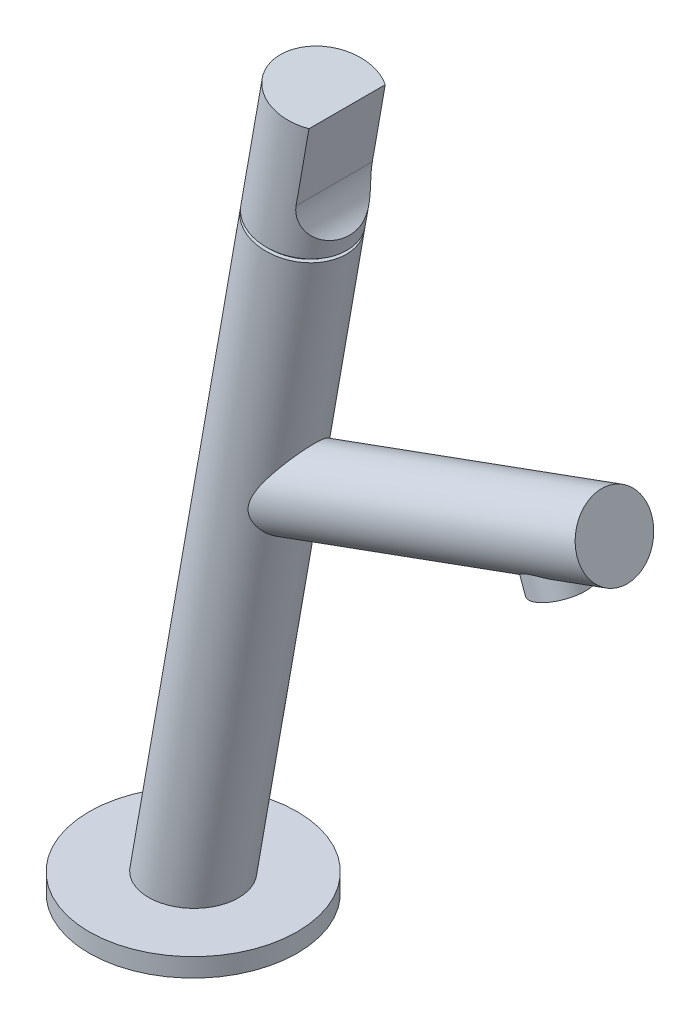
ISO-10303-21;
HEADER;
FILE_DESCRIPTION(('STEP AP214'),'2;1');
FILE_NAME('part.step','',(''),(''),'','','');
FILE_SCHEMA(('AUTOMOTIVE_DESIGN { 1 0 10303 214 1 1 1 1 }'));
ENDSEC;
DATA;
#1=APPLICATION_CONTEXT('core data for automotive mechanical design processes');
#2=APPLICATION_PROTOCOL_DEFINITION('international standard','automotive_design',2000,#1);
#3=PRODUCT_CONTEXT('',#1,'mechanical');
#4=PRODUCT('Part','Part','',(#3));
#5=PRODUCT_RELATED_PRODUCT_CATEGORY('part','',(#4));
#6=PRODUCT_DEFINITION_FORMATION('','',#4);
#7=PRODUCT_DEFINITION_CONTEXT('part definition',#1,'design');
#8=PRODUCT_DEFINITION('design','',#6,#7);
#9=PRODUCT_DEFINITION_SHAPE('','',#8);
#10=(LENGTH_UNIT() NAMED_UNIT(*) SI_UNIT(.MILLI.,.METRE.));
#11=(NAMED_UNIT(*) PLANE_ANGLE_UNIT() SI_UNIT($,.RADIAN.));
#12=(NAMED_UNIT(*) SI_UNIT($,.STERADIAN.) SOLID_ANGLE_UNIT());
#13=UNCERTAINTY_MEASURE_WITH_UNIT(LENGTH_MEASURE(1.E-05),#10,'distance_accuracy_value','');
#14=(GEOMETRIC_REPRESENTATION_CONTEXT(3) GLOBAL_UNCERTAINTY_ASSIGNED_CONTEXT((#13)) GLOBAL_UNIT_ASSIGNED_CONTEXT((#10,
#11,#12)) REPRESENTATION_CONTEXT('',''));
#15=CARTESIAN_POINT('',(0.,0.,0.));
#16=DIRECTION('',(0.,0.,1.));
#17=DIRECTION('',(1.,0.,0.));
#18=AXIS2_PLACEMENT_3D('',#15,#16,#17);
#19=CARTESIAN_POINT('',(17.6326980708469,105.,0.));
#20=DIRECTION('',(-0.93969262078591,-0.342020143325663,0.));
#21=DIRECTION('',(0.342020143325663,-0.93969262078591,0.));
#22=AXIS2_PLACEMENT_3D('',#19,#20,#21);
#23=CYLINDRICAL_SURFACE('',#22,10.);
#24=CARTESIAN_POINT('',(32.6585774148427,121.110750549649,0.));
#25=CARTESIAN_POINT('',(32.6585835440278,121.110758372539,-0.163115194572037));
#26=CARTESIAN_POINT('',(32.6541615840406,121.104890142526,-0.326181896279866));
#27=CARTESIAN_POINT('',(32.6366061158329,121.081584540446,-0.651056407102011));
#28=CARTESIAN_POINT('',(32.6234712922053,121.064145421487,-0.812864022395825));
#29=CARTESIAN_POINT('',(32.588804959874,121.018094162941,-1.13410124492102));
#30=CARTESIAN_POINT('',(32.567265939095,120.989472027407,-1.29352859181342));
#31=CARTESIAN_POINT('',(32.5163103128761,120.921708815068,-1.60885989995229));
#32=CARTESIAN_POINT('',(32.4868919892274,120.882565443932,-1.76476308464786));
#33=CARTESIAN_POINT('',(32.4133349552597,120.784598821704,-2.10698973734964));
#34=CARTESIAN_POINT('',(32.3673719468833,120.723327119445,-2.29222356102336));
#35=CARTESIAN_POINT('',(32.2658538768245,120.587794367288,-2.65510340398815));
#36=CARTESIAN_POINT('',(32.2102965295718,120.513530222265,-2.83274760266616));
#37=CARTESIAN_POINT('',(32.0310348218416,120.273479289291,-3.35383531334456));
#38=CARTESIAN_POINT('',(31.8947933299881,120.090503702427,-3.68520236083959));
#39=CARTESIAN_POINT('',(31.6334274302757,119.737723174151,-4.24007078187062));
#40=CARTESIAN_POINT('',(31.5132270972322,119.574945371901,-4.47060938358298));
#41=CARTESIAN_POINT('',(31.2620124098506,119.233216106846,-4.91328228979928));
#42=CARTESIAN_POINT('',(31.1309920684452,119.054255684391,-5.12540626992633));
#43=CARTESIAN_POINT('',(30.8605643658743,118.682911320156,-5.53265493924905));
#44=CARTESIAN_POINT('',(30.7211398941984,118.490499856004,-5.72774282190645));
#45=CARTESIAN_POINT('',(30.4361785641978,118.094765730483,-6.10182238960264));
#46=CARTESIAN_POINT('',(30.2906395648894,117.89143924021,-6.28080836652553));
#47=CARTESIAN_POINT('',(30.0151134122891,117.503652265959,-6.6006956413746));
#48=CARTESIAN_POINT('',(29.885674485064,117.320343328374,-6.74347838412511));
#49=CARTESIAN_POINT('',(29.624426846889,116.947623959471,-7.01859031894486));
#50=CARTESIAN_POINT('',(29.4926177519202,116.758212535409,-7.15091779795378));
#51=CARTESIAN_POINT('',(29.2273806090984,116.373776939098,-7.40581285969825));
#52=CARTESIAN_POINT('',(29.09395141573,116.178748643417,-7.52837300992077));
#53=CARTESIAN_POINT('',(28.8263516671791,115.783666134087,-7.76414761981822));
#54=CARTESIAN_POINT('',(28.6921811921184,115.583612455627,-7.87736306922264));
#55=CARTESIAN_POINT('',(28.4237907144195,115.178688956517,-8.09493725197289));
#56=CARTESIAN_POINT('',(28.2895707084137,114.973817806502,-8.19929350314242));
#57=CARTESIAN_POINT('',(28.0218808914487,114.559479003019,-8.39946169222506));
#58=CARTESIAN_POINT('',(27.8884110546934,114.350011508837,-8.49527392564708));
#59=CARTESIAN_POINT('',(27.6231034777992,113.926636681918,-8.67855942479455));
#60=CARTESIAN_POINT('',(27.4912648399867,113.712731981941,-8.76603747237573));
#61=CARTESIAN_POINT('',(27.2300510059245,113.280299442793,-8.93286318407677));
#62=CARTESIAN_POINT('',(27.1006757908945,113.061771638894,-9.01221091019936));
#63=CARTESIAN_POINT('',(26.8303373471639,112.593764166889,-9.17171865518467));
#64=CARTESIAN_POINT('',(26.6898145900574,112.343681975092,-9.25086360529841));
#65=CARTESIAN_POINT('',(26.4150024414145,111.837157827087,-9.39883049395722));
#66=CARTESIAN_POINT('',(26.2807119479651,111.580717007531,-9.46765426220674));
#67=CARTESIAN_POINT('',(26.0207274510571,111.061032206365,-9.59447998343542));
#68=CARTESIAN_POINT('',(25.8950290583293,110.79779179447,-9.65248748846466));
#69=CARTESIAN_POINT('',(25.6551967150465,110.263811131705,-9.75683049423396));
#70=CARTESIAN_POINT('',(25.5410602852705,109.993072504593,-9.80316850043408));
#71=CARTESIAN_POINT('',(25.3544743012035,109.51110728481,-9.87294726427189));
#72=CARTESIAN_POINT('',(25.278670966909,109.301594705019,-9.8992165061423));
#73=CARTESIAN_POINT('',(25.1380583473415,108.87797746278,-9.94338589007142));
#74=CARTESIAN_POINT('',(25.0732495230931,108.663872608191,-9.96128568123546));
#75=CARTESIAN_POINT('',(24.957242708444,108.231906773262,-9.98752970784781));
#76=CARTESIAN_POINT('',(24.9060134212286,108.014055683985,-9.9958960645972));
#77=CARTESIAN_POINT('',(24.8196355841844,107.57502673925,-10.0017579733602));
#78=CARTESIAN_POINT('',(24.7844808366538,107.353850199983,-9.99925771901852));
#79=CARTESIAN_POINT('',(24.738549632477,106.960251754469,-9.98387543028362));
#80=CARTESIAN_POINT('',(24.724049713732,106.788166181503,-9.97348037267676));
#81=CARTESIAN_POINT('',(24.7069038376633,106.444088740967,-9.94466851237666));
#82=CARTESIAN_POINT('',(24.7042548302703,106.272096860678,-9.92625377504761));
#83=CARTESIAN_POINT('',(24.711168439564,105.929597222872,-9.88089998289528));
#84=CARTESIAN_POINT('',(24.7207226971649,105.759088529907,-9.85396677262498));
#85=CARTESIAN_POINT('',(24.7518207151686,105.420808026322,-9.79125074743117));
#86=CARTESIAN_POINT('',(24.7733649015991,105.25303631317,-9.75546761807623));
#87=CARTESIAN_POINT('',(24.827603141175,104.921898805145,-9.67505000636879));
#88=CARTESIAN_POINT('',(24.8602713257464,104.758523728681,-9.63043615951594));
#89=CARTESIAN_POINT('',(24.9355489592783,104.436801929553,-9.53241089347394));
#90=CARTESIAN_POINT('',(24.9781585022122,104.278455254437,-9.47899939112391));
#91=CARTESIAN_POINT('',(25.0719143717843,103.967245461311,-9.36352799302043));
#92=CARTESIAN_POINT('',(25.1230749102308,103.814391995623,-9.30145372852911));
#93=CARTESIAN_POINT('',(25.23231650298,103.514846021885,-9.16904084829354));
#94=CARTESIAN_POINT('',(25.2903994425716,103.368155206988,-9.09869998124533));
#95=CARTESIAN_POINT('',(25.4394948203249,103.016105956614,-8.91642344401841));
#96=CARTESIAN_POINT('',(25.5335023732515,102.814283940584,-8.80008306097505));
#97=CARTESIAN_POINT('',(25.7286456810593,102.424173140306,-8.55172024473874));
#98=CARTESIAN_POINT('',(25.8297844410408,102.235890129737,-8.41969118406121));
#99=CARTESIAN_POINT('',(26.0357375811583,101.872464007347,-8.14074789278755));
#100=CARTESIAN_POINT('',(26.1405561264634,101.697336539357,-7.99381641395807));
#101=CARTESIAN_POINT('',(26.3508008400341,101.360228859791,-7.68605398116422));
#102=CARTESIAN_POINT('',(26.4562269388711,101.198247176671,-7.52522458711055));
#103=CARTESIAN_POINT('',(26.6681857456535,100.882877466842,-7.18573712207531));
#104=CARTESIAN_POINT('',(26.7746670089377,100.729856229563,-7.00670635173645));
#105=CARTESIAN_POINT('',(26.9834802762397,100.437442586228,-6.63557305841324));
#106=CARTESIAN_POINT('',(27.0858122134697,100.298050399495,-6.4434703251548));
#107=CARTESIAN_POINT('',(27.2843834982497,100.033039969077,-6.04711349189572));
#108=CARTESIAN_POINT('',(27.3806249586199,99.9074169376033,-5.84286365401973));
#109=CARTESIAN_POINT('',(27.5653921785508,99.6701153129157,-5.42308374337919));
#110=CARTESIAN_POINT('',(27.653917864433,99.5584368528558,-5.20755356292913));
#111=CARTESIAN_POINT('',(27.8322352444692,99.3363342705343,-4.73878463248761));
#112=CARTESIAN_POINT('',(27.9208167467516,99.2277912576614,-4.4841885946432));
#113=CARTESIAN_POINT('',(28.0845793352241,99.0292627492414,-3.96366805034683));
#114=CARTESIAN_POINT('',(28.159759272407,98.9392788447891,-3.69774257496459));
#115=CARTESIAN_POINT('',(28.2951927835254,98.778436648337,-3.15645157394409));
#116=CARTESIAN_POINT('',(28.3554460665817,98.7075787290474,-2.88108586446074));
#117=CARTESIAN_POINT('',(28.4597898385544,98.5855193445931,-2.3230387593486));
#118=CARTESIAN_POINT('',(28.5038815798801,98.5343163562909,-2.04035793240982));
#119=CARTESIAN_POINT('',(28.5730453115178,98.4542462553174,-1.48565032390514));
#120=CARTESIAN_POINT('',(28.5990291713904,98.4243065478258,-1.21389146990775));
#121=CARTESIAN_POINT('',(28.6352749382821,98.3825903006709,-0.667942202577422));
#122=CARTESIAN_POINT('',(28.6455373500802,98.3708131778494,-0.393751867597988));
#123=CARTESIAN_POINT('',(28.6501477849115,98.3655190187764,0.154871913823006));
#124=CARTESIAN_POINT('',(28.644499593468,98.3719976390354,0.429305286908493));
#125=CARTESIAN_POINT('',(28.6174026031899,98.4031521715927,0.976348451901919));
#126=CARTESIAN_POINT('',(28.5959540943933,98.4278277498589,1.24895827719107));
#127=CARTESIAN_POINT('',(28.5388549402682,98.4937938512171,1.77916802609849));
#128=CARTESIAN_POINT('',(28.5038224866392,98.5343618580693,2.03692516795231));
#129=CARTESIAN_POINT('',(28.4201944643896,98.631763519465,2.54709665209512));
#130=CARTESIAN_POINT('',(28.3715993656697,98.6885966104791,2.79951117916207));
#131=CARTESIAN_POINT('',(28.2616709698928,98.8181566326143,3.29733996016417));
#132=CARTESIAN_POINT('',(28.2003395595676,98.8908812096857,3.54275524483574));
#133=CARTESIAN_POINT('',(28.0659552627637,99.0518222572148,4.02514834046211));
#134=CARTESIAN_POINT('',(27.9929020144456,99.1400392059119,4.26212589067783));
#135=CARTESIAN_POINT('',(27.8339752076931,99.3343768387185,4.73316103897609));
#136=CARTESIAN_POINT('',(27.7477869130365,99.4409490788513,4.96692604692305));
#137=CARTESIAN_POINT('',(27.5658051963857,99.6696563556579,5.4228081901721));
#138=CARTESIAN_POINT('',(27.4700115373584,99.7917917764072,5.64492503782448));
#139=CARTESIAN_POINT('',(27.2704364243321,100.051473824103,6.07666866386901));
#140=CARTESIAN_POINT('',(27.1666439428611,100.189041850434,6.28627746592054));
#141=CARTESIAN_POINT('',(26.9532175710008,100.479241873497,6.69163126386777));
#142=CARTESIAN_POINT('',(26.8435836154442,100.631874038299,6.88737610504059));
#143=CARTESIAN_POINT('',(26.6133657576365,100.962890020389,7.27665662398996));
#144=CARTESIAN_POINT('',(26.4925401143603,101.142313689355,7.4691674271816));
#145=CARTESIAN_POINT('',(26.2503043543567,101.518493794434,7.83620239137012));
#146=CARTESIAN_POINT('',(26.1288940914144,101.715254804979,8.01072177884254));
#147=CARTESIAN_POINT('',(25.8899667080383,102.126050271411,8.34017244926375));
#148=CARTESIAN_POINT('',(25.7724427603974,102.340051886618,8.49513959530087));
#149=CARTESIAN_POINT('',(25.5463427947162,102.7859547168,8.78439300551486));
#150=CARTESIAN_POINT('',(25.4377605173172,103.017843186544,8.9186937947806));
#151=CARTESIAN_POINT('',(25.2735463390077,103.409718529625,9.11918910762259));
#152=CARTESIAN_POINT('',(25.2132515421749,103.56433208972,9.19212425793358));
#153=CARTESIAN_POINT('',(25.100510609088,103.880298439205,9.32883937251116));
#154=CARTESIAN_POINT('',(25.0480617566715,104.04164887152,9.39262250477201));
#155=CARTESIAN_POINT('',(24.9529175205297,104.370216987381,9.51055308322418));
#156=CARTESIAN_POINT('',(24.9102007315235,104.537420842774,9.56472161716356));
#157=CARTESIAN_POINT('',(24.8360396351487,104.877135365964,9.663339590701));
#158=CARTESIAN_POINT('',(24.8045952117089,105.049645979097,9.70778913037343));
#159=CARTESIAN_POINT('',(24.7541345759013,105.399688885852,9.78712117489705));
#160=CARTESIAN_POINT('',(24.7351889433524,105.577243889922,9.82194871377079));
#161=CARTESIAN_POINT('',(24.7107237841275,105.934889651566,9.88189353820534));
#162=CARTESIAN_POINT('',(24.7052039124204,106.114980343855,9.90701107329135));
#163=CARTESIAN_POINT('',(24.7075907975414,106.476297733562,9.94802034260204));
#164=CARTESIAN_POINT('',(24.7155119640919,106.657525442379,9.96390215097524));
#165=CARTESIAN_POINT('',(24.7441431228107,107.019505438071,9.9870767060936));
#166=CARTESIAN_POINT('',(24.7648551278332,107.20025764562,9.99436810046698));
#167=CARTESIAN_POINT('',(24.8269696152258,107.621299889983,10.0022989642439));
#168=CARTESIAN_POINT('',(24.873009789799,107.860964265981,9.99983874089815));
#169=CARTESIAN_POINT('',(24.9827116290667,108.335763491882,9.98281341632211));
#170=CARTESIAN_POINT('',(25.0463814941355,108.570896179318,9.96824267560821));
#171=CARTESIAN_POINT('',(25.1881980063599,109.036557637538,9.92857970583605));
#172=CARTESIAN_POINT('',(25.2663880185986,109.267070263357,9.90345566751866));
#173=CARTESIAN_POINT('',(25.4341949254048,109.722736175066,9.84396301395157));
#174=CARTESIAN_POINT('',(25.5238169732966,109.947886989307,9.80959022175515));
#175=CARTESIAN_POINT('',(25.7120474005962,110.39299266046,9.73253734350148));
#176=CARTESIAN_POINT('',(25.8106585398882,110.612945895302,9.68985470150544));
#177=CARTESIAN_POINT('',(26.0148680384677,111.047870165592,9.59684805344182));
#178=CARTESIAN_POINT('',(26.1204653871339,111.26284191561,9.54652515125242));
#179=CARTESIAN_POINT('',(26.3372007398627,111.688372165987,9.4386052058157));
#180=CARTESIAN_POINT('',(26.4483439805361,111.898926218034,9.38100120573475));
#181=CARTESIAN_POINT('',(26.6748302488924,112.315722433039,9.25879844072449));
#182=CARTESIAN_POINT('',(26.7901737640921,112.521964091065,9.19419886210478));
#183=CARTESIAN_POINT('',(27.0242425654894,112.9307308317,9.05799221617883));
#184=CARTESIAN_POINT('',(27.1429738536329,113.133248119028,8.98637208399498));
#185=CARTESIAN_POINT('',(27.3827503621953,113.53431924358,8.83622372907973));
#186=CARTESIAN_POINT('',(27.5037957683274,113.732872760067,8.75769495007719));
#187=CARTESIAN_POINT('',(27.8691202702546,114.32248684976,8.51173267447009));
#188=CARTESIAN_POINT('',(28.1157599871805,114.707797644856,8.3338244398781));
#189=CARTESIAN_POINT('',(28.5803868012147,115.417119543923,7.97171972289332));
#190=CARTESIAN_POINT('',(28.7982470581211,115.742924285523,7.79086138811495));
#191=CARTESIAN_POINT('',(29.2318043393023,116.381303103054,7.40439831152286));
#192=CARTESIAN_POINT('',(29.4475006844863,116.693873118948,7.1987860491983));
#193=CARTESIAN_POINT('',(29.872530836446,117.302436469418,6.76118318491261));
#194=CARTESIAN_POINT('',(30.0818848834541,117.59848581816,6.52929096680271));
#195=CARTESIAN_POINT('',(30.4908972812762,118.171497516375,6.03571296429244));
#196=CARTESIAN_POINT('',(30.6905632097402,118.448474856658,5.77405101842275));
#197=CARTESIAN_POINT('',(31.0853381019661,118.992149535675,5.20264524287717));
#198=CARTESIAN_POINT('',(31.2796754584902,119.257571474953,4.89111303558558));
#199=CARTESIAN_POINT('',(31.5526517673941,119.628284727382,4.3932980940917));
#200=CARTESIAN_POINT('',(31.640563247994,119.747296131927,4.22225551596867));
#201=CARTESIAN_POINT('',(31.8088591676043,119.974558530412,3.86968218026223));
#202=CARTESIAN_POINT('',(31.8892442171621,120.082810397214,3.68815227535071));
#203=CARTESIAN_POINT('',(32.0896573827858,120.35213597271,3.19437329853833));
#204=CARTESIAN_POINT('',(32.2020908448163,120.502620794218,2.87288371211159));
#205=CARTESIAN_POINT('',(32.3462547607993,120.695151381735,2.37143204408946));
#206=CARTESIAN_POINT('',(32.39021114084,120.753772661608,2.20117613589716));
#207=CARTESIAN_POINT('',(32.4690157023817,120.858772239624,1.854894558388));
#208=CARTESIAN_POINT('',(32.50386694728,120.90515465555,1.67887085212052));
#209=CARTESIAN_POINT('',(32.5744647671035,120.999052361117,1.25652439448266));
#210=CARTESIAN_POINT('',(32.6058412597575,121.040730095842,1.00812130377327));
#211=CARTESIAN_POINT('',(32.6478918772314,121.096571856792,0.506439571941107));
#212=CARTESIAN_POINT('',(32.6585679020994,121.110738408207,0.253161380448002));
#213=CARTESIAN_POINT('',(32.6585774148427,121.110750549649,0.));
#214=B_SPLINE_CURVE_WITH_KNOTS('',3,(#24,#25,#26,#27,#28,#29,#30,#31,#32,#33,#34,#35,#36,#37,
#38,#39,#40,#41,#42,#43,#44,#45,#46,#47,#48,#49,#50,#51,#52,#53,#54,#55,#56,#57,#58,#59,#60,#61,
#62,#63,#64,#65,#66,#67,#68,#69,#70,#71,#72,#73,#74,#75,#76,#77,#78,#79,#80,#81,#82,#83,#84,#85,
#86,#87,#88,#89,#90,#91,#92,#93,#94,#95,#96,#97,#98,#99,#100,#101,#102,#103,#104,#105,#106,#107,
#108,#109,#110,#111,#112,#113,#114,#115,#116,#117,#118,#119,#120,#121,#122,#123,#124,#125,#126,
#127,#128,#129,#130,#131,#132,#133,#134,#135,#136,#137,#138,#139,#140,#141,#142,#143,#144,#145,
#146,#147,#148,#149,#150,#151,#152,#153,#154,#155,#156,#157,#158,#159,#160,#161,#162,#163,#164,
#165,#166,#167,#168,#169,#170,#171,#172,#173,#174,#175,#176,#177,#178,#179,#180,#181,#182,#183,
#184,#185,#186,#187,#188,#189,#190,#191,#192,#193,#194,#195,#196,#197,#198,#199,#200,#201,#202,
#203,#204,#205,#206,#207,#208,#209,#210,#211,#212,#213),.UNSPECIFIED.,.T.,.F.,(4,2,2,2,2,2,2,2,
2,2,2,2,2,2,2,2,2,2,2,2,2,2,2,2,2,2,2,2,2,2,2,2,2,2,2,2,2,2,2,2,2,2,2,2,2,2,2,2,2,2,2,2,2,2,2,2,
2,2,2,2,2,2,2,2,2,2,2,2,2,2,2,2,2,2,2,2,2,2,2,2,2,2,2,2,2,2,2,2,2,2,2,2,2,2,4),(0.,
0.489098584460538,0.978271026410201,1.46788171956536,1.95759926725277,2.55801397682528,
3.15857191543547,4.36042090990807,5.27954818595711,6.19918749760886,7.12076692120853,
8.04267176727806,8.84030306429715,9.63806478070862,10.4364278749609,11.2347063030306,
12.0332076601714,12.8316813891099,13.6296941881295,14.4277009009627,15.3201429153883,
16.2124265331929,17.1042508681949,17.9958835635282,18.6685386979945,19.3412220314377,
20.0123412771627,20.6832015474151,21.2016904969924,21.7200459953769,22.238046616999,
22.7560656454661,23.2728881687938,23.7897155777276,24.3074106577753,24.8252470536347,
25.5777370920606,26.33054614814,27.0842366787052,27.8378427241794,28.6125144600088,
29.3871986600648,30.161612627796,30.9360339896633,31.8067081408242,32.6774569049326,
33.5482226361967,34.4189208747842,35.2417822696695,36.0646172438435,36.8872564619029,
37.7098805795835,38.4987848829011,39.2876618566976,40.0764220510879,40.8652065982752,
41.6772706405311,42.4893547271623,43.3025791311426,44.1158126093416,44.9834801495041,
45.8513773119432,46.7176586742345,47.5833283729831,48.1267019816695,48.6698870440843,
49.211865604115,49.753838583247,50.2988464303949,50.8438402711391,51.3894187521773,
51.9350831110773,52.6660454903197,53.3973484463751,54.1308716608698,54.8647267087103,
55.5988078328823,56.332782996481,57.0674648251444,57.8022322002664,58.5383938789568,
59.2746148863352,60.7459878320336,62.0401458979982,63.3346981401091,64.6245548202513,
65.9133858041657,67.2689682689423,67.9468916676648,68.624760025199,69.7368978336195,
70.2923646047831,70.8476442493345,71.6068147236429,72.3659155121505),.UNSPECIFIED.);
#215=CARTESIAN_POINT('',(32.6585774148427,121.110750549649,0.));
#216=VERTEX_POINT('',#215);
#217=EDGE_CURVE('E91',#216,#216,#214,.T.);
#218=ORIENTED_EDGE('',*,*,#217,.F.);
#219=EDGE_LOOP('',(#218));
#220=FACE_BOUND('',#219,.T.);
#221=CARTESIAN_POINT('',(113.314588405633,139.825360040185,0.));
#222=DIRECTION('',(-0.93969262078591,-0.342020143325663,0.));
#223=DIRECTION('',(0.342020143325663,-0.93969262078591,0.));
#224=AXIS2_PLACEMENT_3D('',#221,#222,#223);
#225=CIRCLE('',#224,9.99999999999999);
#226=CARTESIAN_POINT('',(116.73478983889,130.428433832326,0.));
#227=VERTEX_POINT('',#226);
#228=EDGE_CURVE('E182',#227,#227,#225,.T.);
#229=ORIENTED_EDGE('',*,*,#228,.T.);
#230=EDGE_LOOP('',(#229));
#231=FACE_BOUND('',#230,.T.);
#232=CARTESIAN_POINT('',(104.518785768673,125.982171969092,0.));
#233=CARTESIAN_POINT('',(104.518787021234,125.982171433917,-0.1740464643457));
#234=CARTESIAN_POINT('',(104.511121173252,125.984227232528,-0.348081296022131));
#235=CARTESIAN_POINT('',(104.480601750393,125.992378584505,-0.694704313850658));
#236=CARTESIAN_POINT('',(104.457749494529,125.998473787029,-0.867292624321989));
#237=CARTESIAN_POINT('',(104.397252777113,126.014501232162,-1.20970785689396));
#238=CARTESIAN_POINT('',(104.35960474684,126.024434400474,-1.37953410248933));
#239=CARTESIAN_POINT('',(104.270143932486,126.0478116635,-1.71515750012039));
#240=CARTESIAN_POINT('',(104.218330658133,126.061255879734,-1.88095451248456));
#241=CARTESIAN_POINT('',(104.101626901689,126.09115394676,-2.2066220420918));
#242=CARTESIAN_POINT('',(104.036805092623,126.10759195265,-2.36651866830127));
#243=CARTESIAN_POINT('',(103.894796320834,126.143024931631,-2.68045503693136));
#244=CARTESIAN_POINT('',(103.817604515474,126.162020905655,-2.83449245623212));
#245=CARTESIAN_POINT('',(103.568900527168,126.222012422491,-3.28661262536489));
#246=CARTESIAN_POINT('',(103.380157005375,126.266038927187,-3.57498410354819));
#247=CARTESIAN_POINT('',(102.945864986865,126.361170265501,-4.14570734329065));
#248=CARTESIAN_POINT('',(102.69677168198,126.412556829654,-4.42527784942221));
#249=CARTESIAN_POINT('',(102.160557005465,126.511789052028,-4.94680356367577));
#250=CARTESIAN_POINT('',(101.873378777226,126.559629246098,-5.18870133299367));
#251=CARTESIAN_POINT('',(101.392785127656,126.625789120629,-5.54086378447159));
#252=CARTESIAN_POINT('',(101.209420038662,126.648155245969,-5.66433193234375));
#253=CARTESIAN_POINT('',(100.833030704956,126.686505594787,-5.89691627010617));
#254=CARTESIAN_POINT('',(100.640003972106,126.702488164712,-6.00602873649263));
#255=CARTESIAN_POINT('',(100.24593152285,126.725633802041,-6.20896467320644));
#256=CARTESIAN_POINT('',(100.044898785701,126.732810588864,-6.30281172864575));
#257=CARTESIAN_POINT('',(99.6359217361835,126.735657335171,-6.4744747581478));
#258=CARTESIAN_POINT('',(99.427977484552,126.731327395745,-6.55229087304228));
#259=CARTESIAN_POINT('',(99.0728200840661,126.711831787249,-6.66903276954775));
#260=CARTESIAN_POINT('',(98.9268850782301,126.700465243448,-6.71251962436662));
#261=CARTESIAN_POINT('',(98.633523406772,126.669960373543,-6.79082449043627));
#262=CARTESIAN_POINT('',(98.4860971992548,126.650824367546,-6.82564508459341));
#263=CARTESIAN_POINT('',(98.1909575570296,126.603995778551,-6.88610635664974));
#264=CARTESIAN_POINT('',(98.0432449727635,126.576317087459,-6.91176179362068));
#265=CARTESIAN_POINT('',(97.7484555739606,126.511799246914,-6.95354913429054));
#266=CARTESIAN_POINT('',(97.6013787579966,126.474960118037,-6.96968105937952));
#267=CARTESIAN_POINT('',(97.308284158712,126.391624711378,-6.99217933707682));
#268=CARTESIAN_POINT('',(97.1622775169693,126.345073489598,-6.99848832140893));
#269=CARTESIAN_POINT('',(96.8734954367941,126.242616664197,-7.00103012452934));
#270=CARTESIAN_POINT('',(96.7307199864249,126.18671109514,-6.99726298054756));
#271=CARTESIAN_POINT('',(96.4494671206797,126.066106651843,-6.97972342485211));
#272=CARTESIAN_POINT('',(96.3109923218574,126.001402548432,-6.9659450419175));
#273=CARTESIAN_POINT('',(96.0393523874917,125.864211621269,-6.92865962626302));
#274=CARTESIAN_POINT('',(95.9061873623537,125.791724635805,-6.90515239136799));
#275=CARTESIAN_POINT('',(95.5328707919683,125.574399390171,-6.82436103683876));
#276=CARTESIAN_POINT('',(95.2999531598285,125.421274001135,-6.7554564433391));
#277=CARTESIAN_POINT('',(94.8560201743664,125.100297131141,-6.58820457637544));
#278=CARTESIAN_POINT('',(94.6450225638191,124.932433920581,-6.48983369821029));
#279=CARTESIAN_POINT('',(94.2911691344521,124.629881842688,-6.29267017882308));
#280=CARTESIAN_POINT('',(94.1439350005964,124.496641657737,-6.1993830447497));
#281=CARTESIAN_POINT('',(93.8611134434734,124.228825388165,-5.9980524137914));
#282=CARTESIAN_POINT('',(93.7255308142349,124.094248778836,-5.8900028898055));
#283=CARTESIAN_POINT('',(93.4652836544774,123.826129109337,-5.6596572916398));
#284=CARTESIAN_POINT('',(93.3406391509747,123.692588336957,-5.53733600254513));
#285=CARTESIAN_POINT('',(93.1021412756586,123.429097634386,-5.27911187332845));
#286=CARTESIAN_POINT('',(92.9882865258339,123.299147247155,-5.14321077211623));
#287=CARTESIAN_POINT('',(92.7698582530513,123.043456532487,-4.85650052922115));
#288=CARTESIAN_POINT('',(92.6654125762158,122.917785485182,-4.70553198683854));
#289=CARTESIAN_POINT('',(92.4674045146724,122.674499876183,-4.39047411113203));
#290=CARTESIAN_POINT('',(92.3738431434464,122.556886065149,-4.22638355836112));
#291=CARTESIAN_POINT('',(92.1980649877589,122.33213540197,-3.88592051221827));
#292=CARTESIAN_POINT('',(92.1158280745372,122.224980061733,-3.70957067160869));
#293=CARTESIAN_POINT('',(91.9630131244047,122.02314850789,-3.34508447217408));
#294=CARTESIAN_POINT('',(91.8924316084694,121.928468572207,-3.15695165366554));
#295=CARTESIAN_POINT('',(91.7778203266989,121.773101722576,-2.81276640707636));
#296=CARTESIAN_POINT('',(91.7313701423671,121.709527030269,-2.65881551579899));
#297=CARTESIAN_POINT('',(91.6462801441249,121.592287849809,-2.34510246813286));
#298=CARTESIAN_POINT('',(91.6076387553609,121.53862136359,-2.18534149118853));
#299=CARTESIAN_POINT('',(91.5385263302448,121.442146838899,-1.8609232178022));
#300=CARTESIAN_POINT('',(91.5080514732487,121.399333723275,-1.6962682511683));
#301=CARTESIAN_POINT('',(91.4555698805464,121.325340499887,-1.363024423342));
#302=CARTESIAN_POINT('',(91.4335633171631,121.294160628851,-1.19443548217044));
#303=CARTESIAN_POINT('',(91.3982089363871,121.243963219187,-0.853835038131658));
#304=CARTESIAN_POINT('',(91.3848970766268,121.22499619226,-0.681812316714426));
#305=CARTESIAN_POINT('',(91.3672492968561,121.199834142727,-0.336372899362727));
#306=CARTESIAN_POINT('',(91.3629133753943,121.193639118054,-0.162956203653694));
#307=CARTESIAN_POINT('',(91.3632756904513,121.194156384205,0.183842714295633));
#308=CARTESIAN_POINT('',(91.3679736730716,121.200868312277,0.357224937367816));
#309=CARTESIAN_POINT('',(91.386340402398,121.227052544406,0.702536349823644));
#310=CARTESIAN_POINT('',(91.4000088267941,121.246524389996,0.874465591188444));
#311=CARTESIAN_POINT('',(91.43495201614,121.296126440017,1.20433159742845));
#312=CARTESIAN_POINT('',(91.4556691504334,121.325473894298,1.3624465460305));
#313=CARTESIAN_POINT('',(91.5045710860889,121.394432887431,1.6752967520272));
#314=CARTESIAN_POINT('',(91.5327584286907,121.434047919039,1.83003083988353));
#315=CARTESIAN_POINT('',(91.5963240976734,121.522863367647,2.13515144391824));
#316=CARTESIAN_POINT('',(91.631700432097,121.572061129265,2.28553915125477));
#317=CARTESIAN_POINT('',(91.7093733798167,121.679304896292,2.58133987412349));
#318=CARTESIAN_POINT('',(91.7516726375147,121.737354282241,2.72675096293517));
#319=CARTESIAN_POINT('',(91.8461051797945,121.865834440002,3.02198830167896));
#320=CARTESIAN_POINT('',(91.8987206157152,121.936848592446,3.17140685506114));
#321=CARTESIAN_POINT('',(92.0112165647709,122.087008478879,3.46327176168365));
#322=CARTESIAN_POINT('',(92.0710997411316,122.166157192099,3.60571553205286));
#323=CARTESIAN_POINT('',(92.261273565767,122.414287838812,4.0219990302419));
#324=CARTESIAN_POINT('',(92.4021132036811,122.593988532754,4.28486774744838));
#325=CARTESIAN_POINT('',(92.6463138980461,122.894474366115,4.67606291543348));
#326=CARTESIAN_POINT('',(92.7410400538969,123.008837296274,4.81502294558395));
#327=CARTESIAN_POINT('',(92.9395949913232,123.242741339593,5.0817445026344));
#328=CARTESIAN_POINT('',(93.0434250421635,123.362283173617,5.20950446303962));
#329=CARTESIAN_POINT('',(93.2603633441491,123.604901568294,5.45354754357961));
#330=CARTESIAN_POINT('',(93.3734800769528,123.727981291971,5.56981995358198));
#331=CARTESIAN_POINT('',(93.6091603843487,123.975736110891,5.79035746552295));
#332=CARTESIAN_POINT('',(93.7317200962199,124.100410536587,5.89462743407489));
#333=CARTESIAN_POINT('',(93.9745534296361,124.337533420886,6.08134275267697));
#334=CARTESIAN_POINT('',(94.0939264587428,124.450011772536,6.16492148820637));
#335=CARTESIAN_POINT('',(94.3411551309539,124.673097389388,6.32141996440221));
#336=CARTESIAN_POINT('',(94.4690109942558,124.783704605926,6.39433942821761));
#337=CARTESIAN_POINT('',(94.7333351443997,125.001052449825,6.5287949252383));
#338=CARTESIAN_POINT('',(94.8697898617956,125.107798770627,6.5903483198205));
#339=CARTESIAN_POINT('',(95.1516484885905,125.315544896735,6.70145001643239));
#340=CARTESIAN_POINT('',(95.2970489875502,125.416546864071,6.75100285835528));
#341=CARTESIAN_POINT('',(95.5663960157317,125.591022217516,6.82857902465688));
#342=CARTESIAN_POINT('',(95.6887423393967,125.665934741845,6.85892939729142));
#343=CARTESIAN_POINT('',(95.9387071182716,125.80957515667,6.91105535539408));
#344=CARTESIAN_POINT('',(96.066322506981,125.878306572449,6.93283585276948));
#345=CARTESIAN_POINT('',(96.3262315913337,126.008542495842,6.96747926947811));
#346=CARTESIAN_POINT('',(96.4585210590167,126.070053327626,6.98035004155079));
#347=CARTESIAN_POINT('',(96.7270944930778,126.185090905232,6.99697364311951));
#348=CARTESIAN_POINT('',(96.8633784991179,126.238617571747,7.0007263820508));
#349=CARTESIAN_POINT('',(97.1390994937406,126.337213442716,6.99904059888436));
#350=CARTESIAN_POINT('',(97.2785400515425,126.382272476143,6.99359110081427));
#351=CARTESIAN_POINT('',(97.5592862949924,126.463682353709,6.97358403682475));
#352=CARTESIAN_POINT('',(97.7005919692742,126.500033250891,6.95902652638542));
#353=CARTESIAN_POINT('',(97.9840791728746,126.564250128931,6.92104181350055));
#354=CARTESIAN_POINT('',(98.1262614539106,126.59210733911,6.89760549830521));
#355=CARTESIAN_POINT('',(98.4103756092636,126.639793037621,6.84221801726316));
#356=CARTESIAN_POINT('',(98.552307289455,126.659616839378,6.81026189905508));
#357=CARTESIAN_POINT('',(98.8748288725776,126.696473334668,6.72808899651138));
#358=CARTESIAN_POINT('',(99.0550274198369,126.711140443095,6.67526394894724));
#359=CARTESIAN_POINT('',(99.4118695886026,126.730131042527,6.55716725420651));
#360=CARTESIAN_POINT('',(99.5885118034495,126.734450517382,6.49189078496199));
#361=CARTESIAN_POINT('',(99.9372078767111,126.734540556891,6.34959408882448));
#362=CARTESIAN_POINT('',(100.109256275689,126.730301371636,6.27256056086393));
#363=CARTESIAN_POINT('',(100.44760846235,126.714960945754,6.10743986637676));
#364=CARTESIAN_POINT('',(100.613912585952,126.703860107106,6.01935334761554));
#365=CARTESIAN_POINT('',(100.943856103253,126.676016927429,5.83039985250674));
#366=CARTESIAN_POINT('',(101.107339787868,126.659147533952,5.72928015678097));
#367=CARTESIAN_POINT('',(101.426726210281,126.621306264168,5.51633004524502));
#368=CARTESIAN_POINT('',(101.582627135116,126.600333412726,5.40449708679431));
#369=CARTESIAN_POINT('',(101.886026861364,126.555590469871,5.170427674824));
#370=CARTESIAN_POINT('',(102.033524566235,126.531820014632,5.04818986873541));
#371=CARTESIAN_POINT('',(102.31924696375,126.4826506132,4.7935727813586));
#372=CARTESIAN_POINT('',(102.457469998518,126.457251377437,4.66119169593813));
#373=CARTESIAN_POINT('',(102.748243097816,126.401150050372,4.36120938579075));
#374=CARTESIAN_POINT('',(102.898729533792,126.370334380396,4.19161700666254));
#375=CARTESIAN_POINT('',(103.183447769268,126.309558149408,3.83925101000358));
#376=CARTESIAN_POINT('',(103.317686809038,126.279597212088,3.65648332210734));
#377=CARTESIAN_POINT('',(103.56793843053,126.22202641832,3.27862084786243));
#378=CARTESIAN_POINT('',(103.683960880248,126.19441529271,3.08353281636738));
#379=CARTESIAN_POINT('',(103.895729130923,126.142909073151,2.68218321290247));
#380=CARTESIAN_POINT('',(103.991480657703,126.119012930359,2.47592481689524));
#381=CARTESIAN_POINT('',(104.147897287249,126.079385258298,2.08573668920925));
#382=CARTESIAN_POINT('',(104.211674649023,126.062966123332,1.90312178265014));
#383=CARTESIAN_POINT('',(104.321958537493,126.034320908334,1.53241768450134));
#384=CARTESIAN_POINT('',(104.368466863792,126.0220943914,1.34432906553012));
#385=CARTESIAN_POINT('',(104.443235311414,126.002337304288,0.964513904056693));
#386=CARTESIAN_POINT('',(104.471514795287,125.994801751692,0.772791445042059));
#387=CARTESIAN_POINT('',(104.509288520109,125.984719596157,0.387374408391205));
#388=CARTESIAN_POINT('',(104.518784374815,125.982172564638,0.193680001608241));
#389=CARTESIAN_POINT('',(104.518785768673,125.982171969092,0.));
#390=B_SPLINE_CURVE_WITH_KNOTS('',3,(#232,#233,#234,#235,#236,#237,#238,#239,#240,#241,#242,
#243,#244,#245,#246,#247,#248,#249,#250,#251,#252,#253,#254,#255,#256,#257,#258,#259,#260,#261,
#262,#263,#264,#265,#266,#267,#268,#269,#270,#271,#272,#273,#274,#275,#276,#277,#278,#279,#280,
#281,#282,#283,#284,#285,#286,#287,#288,#289,#290,#291,#292,#293,#294,#295,#296,#297,#298,#299,
#300,#301,#302,#303,#304,#305,#306,#307,#308,#309,#310,#311,#312,#313,#314,#315,#316,#317,#318,
#319,#320,#321,#322,#323,#324,#325,#326,#327,#328,#329,#330,#331,#332,#333,#334,#335,#336,#337,
#338,#339,#340,#341,#342,#343,#344,#345,#346,#347,#348,#349,#350,#351,#352,#353,#354,#355,#356,
#357,#358,#359,#360,#361,#362,#363,#364,#365,#366,#367,#368,#369,#370,#371,#372,#373,#374,#375,
#376,#377,#378,#379,#380,#381,#382,#383,#384,#385,#386,#387,#388,#389),.UNSPECIFIED.,.T.,.F.,(4,
2,2,2,2,2,2,2,2,2,2,2,2,2,2,2,2,2,2,2,2,2,2,2,2,2,2,2,2,2,2,2,2,2,2,2,2,2,2,2,2,2,2,2,2,2,2,2,2,
2,2,2,2,2,2,2,2,2,2,2,2,2,2,2,2,2,2,2,2,2,2,2,2,2,2,2,2,2,4),(0.,0.521940082502913,
1.04383483789937,1.56585555093393,2.08789433384088,2.60724648923537,3.126802460827,
4.16502349398294,5.29494339347712,6.42656953828168,7.09249032242578,7.75858349063624,
8.42363756178255,9.0886857901823,9.54639205919713,10.0039617488919,10.4607912359169,
10.9176196968873,11.3771062669169,11.8365911392086,12.2963502972639,12.7561190100489,
13.6141081365684,14.4727864231514,15.130156953742,15.7877966781805,16.4466164149075,
17.1053518968934,17.7719963889593,18.4387029053975,19.1042086449151,19.7695153768553,
20.2877540515521,20.8058881049417,21.3237793287274,21.8416810906236,22.3617113379097,
22.8817415010981,23.4017570490098,23.9217539136704,24.4076481362481,24.8937078645481,
25.379633096477,25.8657443760328,26.3860125240346,26.9064719005289,27.9471301111631,
28.5568022331425,29.1665594911553,29.7768799802538,30.3869521253026,30.9387294982876,
31.4905211999264,32.0414629529764,32.592195954171,33.0316663352392,33.470884461381,
33.9097149805133,34.3485498583069,34.7879085263931,35.2272645182171,35.6670726695243,
36.1071370304772,36.6713632956834,37.2358085143272,37.8008971039949,38.3659525918506,
38.9443539578271,39.5228929408527,40.1015072457347,40.6802247057011,41.3657442312098,
42.0509571374609,42.7357975710089,43.4204443023647,44.0019917129301,44.5834785035523,
45.1643466206592,45.7451648314663),.UNSPECIFIED.);
#391=CARTESIAN_POINT('',(104.518785768673,125.982171969092,0.));
#392=VERTEX_POINT('',#391);
#393=EDGE_CURVE('E52',#392,#392,#390,.T.);
#394=ORIENTED_EDGE('',*,*,#393,.T.);
#395=EDGE_LOOP('',(#394));
#396=FACE_BOUND('',#395,.T.);
#397=ADVANCED_FACE('F47',(#220,#231,#396),#23,.T.);
#398=CARTESIAN_POINT('',(0.,5.,0.));
#399=DIRECTION('',(0.,1.,0.));
#400=DIRECTION('',(0.,0.,1.));
#401=AXIS2_PLACEMENT_3D('',#398,#399,#400);
#402=PLANE('',#401);
#403=CARTESIAN_POINT('',(0.,5.,0.));
#404=DIRECTION('',(0.,1.,0.));
#405=DIRECTION('',(0.,0.,1.));
#406=AXIS2_PLACEMENT_3D('',#403,#404,#405);
#407=CIRCLE('',#406,28.);
#408=CARTESIAN_POINT('',(0.,5.,28.));
#409=VERTEX_POINT('',#408);
#410=EDGE_CURVE('E105',#409,#409,#407,.T.);
#411=ORIENTED_EDGE('',*,*,#410,.T.);
#412=EDGE_LOOP('',(#411));
#413=FACE_BOUND('',#412,.T.);
#414=CARTESIAN_POINT('',(0.,5.,0.));
#415=DIRECTION('',(0.,1.,0.));
#416=DIRECTION('',(-1.,0.,0.));
#417=AXIS2_PLACEMENT_3D('',#414,#415,#416);
#418=ELLIPSE('',#417,12.1851193426289,12.);
#419=CARTESIAN_POINT('',(-12.1851193426289,5.,0.));
#420=VERTEX_POINT('',#419);
#421=EDGE_CURVE('E94',#420,#420,#418,.F.);
#422=ORIENTED_EDGE('',*,*,#421,.T.);
#423=EDGE_LOOP('',(#422));
#424=FACE_BOUND('',#423,.T.);
#425=ADVANCED_FACE('F126',(#413,#424),#402,.T.);
#426=CARTESIAN_POINT('',(0.,5.,0.));
#427=DIRECTION('',(0.,-1.,0.));
#428=DIRECTION('',(0.,0.,-1.));
#429=AXIS2_PLACEMENT_3D('',#426,#427,#428);
#430=CYLINDRICAL_SURFACE('',#429,28.);
#431=ORIENTED_EDGE('',*,*,#410,.F.);
#432=EDGE_LOOP('',(#431));
#433=FACE_BOUND('',#432,.T.);
#434=CARTESIAN_POINT('',(0.,0.,0.));
#435=DIRECTION('',(0.,1.,0.));
#436=DIRECTION('',(0.,0.,1.));
#437=AXIS2_PLACEMENT_3D('',#434,#435,#436);
#438=CIRCLE('',#437,28.);
#439=CARTESIAN_POINT('',(0.,0.,28.));
#440=VERTEX_POINT('',#439);
#441=EDGE_CURVE('E98',#440,#440,#438,.T.);
#442=ORIENTED_EDGE('',*,*,#441,.T.);
#443=EDGE_LOOP('',(#442));
#444=FACE_BOUND('',#443,.T.);
#445=ADVANCED_FACE('F129',(#433,#444),#430,.T.);
#446=CARTESIAN_POINT('',(0.,0.,0.));
#447=DIRECTION('',(0.,1.,0.));
#448=DIRECTION('',(0.,0.,1.));
#449=AXIS2_PLACEMENT_3D('',#446,#447,#448);
#450=PLANE('',#449);
#451=ORIENTED_EDGE('',*,*,#441,.F.);
#452=EDGE_LOOP('',(#451));
#453=FACE_BOUND('',#452,.T.);
#454=ADVANCED_FACE('F125',(#453),#450,.F.);
#455=CARTESIAN_POINT('',(35.2653961416938,205.,0.));
#456=DIRECTION('',(-0.173648177666934,-0.984807753012207,0.));
#457=DIRECTION('',(0.984807753012207,-0.173648177666934,0.));
#458=AXIS2_PLACEMENT_3D('',#455,#456,#457);
#459=PLANE('',#458);
#460=CARTESIAN_POINT('',(35.2653961416938,205.,0.));
#461=DIRECTION('',(-0.173648177666934,-0.984807753012207,0.));
#462=DIRECTION('',(0.984807753012207,-0.173648177666934,0.));
#463=AXIS2_PLACEMENT_3D('',#460,#461,#462);
#464=CIRCLE('',#463,12.);
#465=CARTESIAN_POINT('',(41.3999569750965,203.918311410274,10.2565643943836));
#466=VERTEX_POINT('',#465);
#467=CARTESIAN_POINT('',(41.3999569750965,203.918311410274,-10.2565643943836));
#468=VERTEX_POINT('',#467);
#469=EDGE_CURVE('E83',#466,#468,#464,.T.);
#470=ORIENTED_EDGE('',*,*,#469,.F.);
#471=DIRECTION('',(0.,0.,1.));
#472=VECTOR('',#471,1.);
#473=CARTESIAN_POINT('',(41.3999569750965,203.918311410274,-10.2565643943836));
#474=LINE('',#473,#472);
#475=EDGE_CURVE('E86',#468,#466,#474,.T.);
#476=ORIENTED_EDGE('',*,*,#475,.F.);
#477=EDGE_LOOP('',(#470,#476));
#478=FACE_BOUND('',#477,.T.);
#479=ADVANCED_FACE('F93',(#478),#459,.F.);
#480=CARTESIAN_POINT('',(0.,5.,0.));
#481=DIRECTION('',(-0.173648177666934,-0.984807753012207,0.));
#482=DIRECTION('',(0.984807753012207,-0.173648177666934,0.));
#483=AXIS2_PLACEMENT_3D('',#480,#481,#482);
#484=CYLINDRICAL_SURFACE('',#483,12.);
#485=ORIENTED_EDGE('',*,*,#469,.T.);
#486=DIRECTION('',(0.173648177666934,0.984807753012207,0.));
#487=VECTOR('',#486,1.);
#488=CARTESIAN_POINT('',(36.1905116450884,174.374078819908,-10.2565643943836));
#489=LINE('',#488,#487);
#490=CARTESIAN_POINT('',(37.9269934217578,184.22215635003,-10.2565643943836));
#491=VERTEX_POINT('',#490);
#492=EDGE_CURVE('E85',#491,#468,#489,.T.);
#493=ORIENTED_EDGE('',*,*,#492,.F.);
#494=CARTESIAN_POINT('',(37.9269934217578,184.22215635003,-10.2565643943836));
#495=CARTESIAN_POINT('',(37.9066081075563,184.106549193404,-10.2565620754043));
#496=CARTESIAN_POINT('',(37.8882625178448,183.990596187263,-10.2553090741105));
#497=CARTESIAN_POINT('',(37.8556696466141,183.758171862468,-10.2502852029839));
#498=CARTESIAN_POINT('',(37.8414222984412,183.641700552274,-10.2465143741042));
#499=CARTESIAN_POINT('',(37.8048576880096,183.291789216775,-10.2314014377815));
#500=CARTESIAN_POINT('',(37.7887133706149,183.057826298024,-10.2162588873485));
#501=CARTESIAN_POINT('',(37.7728731420042,182.590023756521,-10.175523125176));
#502=CARTESIAN_POINT('',(37.7731950557699,182.356184541422,-10.1499186179202));
#503=CARTESIAN_POINT('',(37.7900777697465,181.890551294049,-10.0877759541816));
#504=CARTESIAN_POINT('',(37.8066378747997,181.658757174653,-10.0512382657951));
#505=CARTESIAN_POINT('',(37.8555406725851,181.198611447533,-9.96653824546557));
#506=CARTESIAN_POINT('',(37.8879075942294,180.970265681226,-9.9183581252995));
#507=CARTESIAN_POINT('',(37.9676546964221,180.519196927492,-9.80968242622656));
#508=CARTESIAN_POINT('',(38.0150342634384,180.296473710686,-9.74918735063953));
#509=CARTESIAN_POINT('',(38.1236516307783,179.858717666695,-9.61520925526207));
#510=CARTESIAN_POINT('',(38.1848737957028,179.643676477468,-9.5417409093027));
#511=CARTESIAN_POINT('',(38.319774652425,179.22282385606,-9.38108525842699));
#512=CARTESIAN_POINT('',(38.3934528864518,179.017012085041,-9.29389845768363));
#513=CARTESIAN_POINT('',(38.549521569461,178.621305763027,-9.10761824696849));
#514=CARTESIAN_POINT('',(38.6316492633863,178.431142414707,-9.00887555153792));
#515=CARTESIAN_POINT('',(38.8041262459171,178.062605058859,-8.79754575941973));
#516=CARTESIAN_POINT('',(38.8944753619856,177.884230804057,-8.68495895325088));
#517=CARTESIAN_POINT('',(39.0812422224688,177.54041158869,-8.44590628004596));
#518=CARTESIAN_POINT('',(39.1776604137248,177.374967582141,-8.31943939056444));
#519=CARTESIAN_POINT('',(39.3742591054216,177.057860047418,-8.05289791869557));
#520=CARTESIAN_POINT('',(39.4744395938386,176.90619647521,-7.91282337979389));
#521=CARTESIAN_POINT('',(39.6740389336584,176.6202650547,-7.62279736789491));
#522=CARTESIAN_POINT('',(39.7734272211698,176.485691385282,-7.47312581649854));
#523=CARTESIAN_POINT('',(39.9714497958915,176.230307833134,-7.16202690920682));
#524=CARTESIAN_POINT('',(40.0700840962176,176.109497710473,-7.00059975831989));
#525=CARTESIAN_POINT('',(40.2646473547108,175.881432153481,-6.66686235965948));
#526=CARTESIAN_POINT('',(40.3605757541288,175.774179502982,-6.49454988759994));
#527=CARTESIAN_POINT('',(40.5479389562196,175.572825507892,-6.14008698084134));
#528=CARTESIAN_POINT('',(40.6393735268379,175.478724841988,-5.95793603911601));
#529=CARTESIAN_POINT('',(40.8229909265898,175.296335379404,-5.57055863911184));
#530=CARTESIAN_POINT('',(40.9146931325527,175.209046112433,-5.36463390485512));
#531=CARTESIAN_POINT('',(41.0894820023417,175.048133526613,-4.94398911877658));
#532=CARTESIAN_POINT('',(41.1725682890135,174.974510805894,-4.72926868250392));
#533=CARTESIAN_POINT('',(41.3288609943239,174.839955450252,-4.29223577476675));
#534=CARTESIAN_POINT('',(41.4020613209386,174.779030627706,-4.06991872680742));
#535=CARTESIAN_POINT('',(41.5374832589531,174.669018768797,-3.61910448954847));
#536=CARTESIAN_POINT('',(41.5997043565313,174.619932286421,-3.39060701158512));
#537=CARTESIAN_POINT('',(41.7202951636718,174.526634937496,-2.89612299236502));
#538=CARTESIAN_POINT('',(41.7768889918321,174.484083762706,-2.62938799074985));
#539=CARTESIAN_POINT('',(41.8738643253329,174.412298781722,-2.0912034546591));
#540=CARTESIAN_POINT('',(41.9142438172464,174.383066629367,-1.81975333904433));
#541=CARTESIAN_POINT('',(41.9781978694681,174.33718945488,-1.27392780739212));
#542=CARTESIAN_POINT('',(42.0017781256652,174.32054016633,-0.999553414904747));
#543=CARTESIAN_POINT('',(42.0318311642724,174.299372451677,-0.449433096585925));
#544=CARTESIAN_POINT('',(42.038306361684,174.2948523131,-0.173687369876541));
#545=CARTESIAN_POINT('',(42.0345056517556,174.297519109927,0.321649559428828));
#546=CARTESIAN_POINT('',(42.0273613375204,174.302517209055,0.541284997478902));
#547=CARTESIAN_POINT('',(42.0022181502232,174.320234394726,0.979670775952153));
#548=CARTESIAN_POINT('',(41.9842172595475,174.332954916425,1.19842094424551));
#549=CARTESIAN_POINT('',(41.9375116357107,174.366331948468,1.63417615237083));
#550=CARTESIAN_POINT('',(41.9088065251652,174.38698873861,1.85118113039934));
#551=CARTESIAN_POINT('',(41.8409596048096,174.436570107277,2.28254972669192));
#552=CARTESIAN_POINT('',(41.801819921453,174.465493001344,2.49691387382723));
#553=CARTESIAN_POINT('',(41.7035922847651,174.53949626532,2.96969828623427));
#554=CARTESIAN_POINT('',(41.6420015377226,174.586742371606,3.2272682463681));
#555=CARTESIAN_POINT('',(41.50466288065,174.69531914728,3.73560690784792));
#556=CARTESIAN_POINT('',(41.428913594992,174.756651185374,3.98637494561336));
#557=CARTESIAN_POINT('',(41.2644877387009,174.894638499502,4.47948519275197));
#558=CARTESIAN_POINT('',(41.1758046605453,174.971301496422,4.72182308410121));
#559=CARTESIAN_POINT('',(40.9872101523763,175.141217674247,5.19610612493452));
#560=CARTESIAN_POINT('',(40.8872991020816,175.23447029417,5.42805162550793));
#561=CARTESIAN_POINT('',(40.677708218537,175.439466100728,5.88110433507967));
#562=CARTESIAN_POINT('',(40.5679709909021,175.551321703454,6.10213435343157));
#563=CARTESIAN_POINT('',(40.3419268679815,175.794197034927,6.52988546449062));
#564=CARTESIAN_POINT('',(40.2256198915881,175.925217000302,6.7366063804728));
#565=CARTESIAN_POINT('',(39.989715002741,176.206985209828,7.13374453481489));
#566=CARTESIAN_POINT('',(39.8701206907095,176.357712500292,7.32417873912618));
#567=CARTESIAN_POINT('',(39.6310847840369,176.679163908264,7.68745319727301));
#568=CARTESIAN_POINT('',(39.5116431708989,176.849885313536,7.86029583150314));
#569=CARTESIAN_POINT('',(39.2886395434475,177.192479695837,8.17068435889933));
#570=CARTESIAN_POINT('',(39.1846965982136,177.3624755577,8.31003221127522));
#571=CARTESIAN_POINT('',(38.9827569532172,177.717354714212,8.5732157239474));
#572=CARTESIAN_POINT('',(38.8847598964645,177.902237113522,8.6970523160135));
#573=CARTESIAN_POINT('',(38.6973514100354,178.285611793746,8.92913003815041));
#574=CARTESIAN_POINT('',(38.6079393187114,178.484103023796,9.03737237040091));
#575=CARTESIAN_POINT('',(38.4400672809795,178.893104354932,9.23854472622456));
#576=CARTESIAN_POINT('',(38.3616069485029,179.103614031979,9.33147528958538));
#577=CARTESIAN_POINT('',(38.2231896588103,179.518248610787,9.49600693708146));
#578=CARTESIAN_POINT('',(38.1622748245594,179.721623850786,9.568697556296));
#579=CARTESIAN_POINT('',(38.0528028535447,180.135500878667,9.7020772703911));
#580=CARTESIAN_POINT('',(38.0042452628731,180.346002404463,9.76276680607874));
#581=CARTESIAN_POINT('',(37.9204905270704,180.772628886068,9.87280396876988));
#582=CARTESIAN_POINT('',(37.8852982107607,180.988755844245,9.92214749396865));
#583=CARTESIAN_POINT('',(37.8290518593382,181.424984588818,10.0101019205677));
#584=CARTESIAN_POINT('',(37.8079970293417,181.645086151027,10.0487134253069));
#585=CARTESIAN_POINT('',(37.7821425588134,182.061755171468,10.1118475756071));
#586=CARTESIAN_POINT('',(37.7757262565409,182.258055663582,10.1374914118382));
#587=CARTESIAN_POINT('',(37.7745110372762,182.651522995658,10.1811943959175));
#588=CARTESIAN_POINT('',(37.779711239548,182.848689768809,10.1992541186518));
#589=CARTESIAN_POINT('',(37.8018128851479,183.242616582509,10.2280230470378));
#590=CARTESIAN_POINT('',(37.8186976183722,183.439376801945,10.2387427062502));
#591=CARTESIAN_POINT('',(37.8641166263232,183.831818360431,10.253004449836));
#592=CARTESIAN_POINT('',(37.8926513849444,184.027499654326,10.2565462360333));
#593=CARTESIAN_POINT('',(37.9269934217578,184.22215635003,10.2565643943836));
#594=B_SPLINE_CURVE_WITH_KNOTS('',3,(#494,#495,#496,#497,#498,#499,#500,#501,#502,#503,#504,
#505,#506,#507,#508,#509,#510,#511,#512,#513,#514,#515,#516,#517,#518,#519,#520,#521,#522,#523,
#524,#525,#526,#527,#528,#529,#530,#531,#532,#533,#534,#535,#536,#537,#538,#539,#540,#541,#542,
#543,#544,#545,#546,#547,#548,#549,#550,#551,#552,#553,#554,#555,#556,#557,#558,#559,#560,#561,
#562,#563,#564,#565,#566,#567,#568,#569,#570,#571,#572,#573,#574,#575,#576,#577,#578,#579,#580,
#581,#582,#583,#584,#585,#586,#587,#588,#589,#590,#591,#592,#593),.UNSPECIFIED.,.F.,.F.,(4,2,2,
2,2,2,2,2,2,2,2,2,2,2,2,2,2,2,2,2,2,2,2,2,2,2,2,2,2,2,2,2,2,2,2,2,2,2,2,2,2,2,2,2,2,2,2,2,2,4),
(0.,0.352119954788079,0.704234182380675,1.40838523347311,2.11329855643838,2.81818170335269,
3.52414871251215,4.23008687415517,4.93523161758267,5.64035045197535,6.32790387413733,
7.01544287044674,7.70303254682167,8.39062002595295,9.06330269935385,9.73597364450546,
10.4087824893882,11.0816260406695,11.8060825234695,12.5305707053542,13.2555033210166,
13.9804698541144,14.8075149011415,15.6346626153461,16.4615297461445,17.2882801283079,
17.9473198801343,18.6064821473353,19.2656676559403,19.9247189321946,20.7309264160967,
21.5372122709822,22.3439052099707,23.1505708756232,23.9623011472309,24.7740414423482,
25.5849255736274,26.3956998342329,27.1241484511719,27.8525532888006,28.5809019427682,
29.3092249146742,29.9816582888,30.6540669594501,31.3267183381269,31.9993318936425,
32.5930700176781,33.1867631274227,33.7796089436913,34.372479386867),.UNSPECIFIED.);
#595=CARTESIAN_POINT('',(37.9269934217578,184.22215635003,10.2565643943836));
#596=VERTEX_POINT('',#595);
#597=EDGE_CURVE('E13',#491,#596,#594,.T.);
#598=ORIENTED_EDGE('',*,*,#597,.T.);
#599=DIRECTION('',(0.173648177666934,0.984807753012207,0.));
#600=VECTOR('',#599,1.);
#601=CARTESIAN_POINT('',(36.1905116450884,174.374078819908,10.2565643943836));
#602=LINE('',#601,#600);
#603=EDGE_CURVE('E78',#596,#466,#602,.T.);
#604=ORIENTED_EDGE('',*,*,#603,.T.);
#605=EDGE_LOOP('',(#485,#493,#598,#604));
#606=FACE_BOUND('',#605,.T.);
#607=CARTESIAN_POINT('',(29.5350062786849,172.501344150597,0.));
#608=DIRECTION('',(-0.173648177666934,-0.984807753012207,0.));
#609=DIRECTION('',(0.984807753012207,-0.173648177666934,0.));
#610=AXIS2_PLACEMENT_3D('',#607,#608,#609);
#611=CIRCLE('',#610,12.);
#612=CARTESIAN_POINT('',(41.3526993148314,170.417566018594,0.));
#613=VERTEX_POINT('',#612);
#614=EDGE_CURVE('E95',#613,#613,#611,.T.);
#615=ORIENTED_EDGE('',*,*,#614,.F.);
#616=EDGE_LOOP('',(#615));
#617=FACE_BOUND('',#616,.T.);
#618=ADVANCED_FACE('F80',(#606,#617),#484,.T.);
#619=CARTESIAN_POINT('',(17.7173132425385,174.5851222826,0.));
#620=DIRECTION('',(0.173648177666934,0.984807753012207,0.));
#621=DIRECTION('',(-0.984807753012207,0.173648177666934,0.));
#622=AXIS2_PLACEMENT_3D('',#619,#620,#621);
#623=PLANE('',#622);
#624=CARTESIAN_POINT('',(29.5350062786849,172.501344150597,0.));
#625=DIRECTION('',(-0.173648177666934,-0.984807753012207,0.));
#626=DIRECTION('',(0.984807753012207,-0.173648177666934,0.));
#627=AXIS2_PLACEMENT_3D('',#624,#625,#626);
#628=CIRCLE('',#627,11.);
#629=CARTESIAN_POINT('',(40.3678915618192,170.591214196261,0.));
#630=VERTEX_POINT('',#629);
#631=EDGE_CURVE('E101',#630,#630,#628,.T.);
#632=ORIENTED_EDGE('',*,*,#631,.F.);
#633=EDGE_LOOP('',(#632));
#634=FACE_BOUND('',#633,.T.);
#635=ORIENTED_EDGE('',*,*,#614,.T.);
#636=EDGE_LOOP('',(#635));
#637=FACE_BOUND('',#636,.T.);
#638=ADVANCED_FACE('F121',(#634,#637),#623,.F.);
#639=CARTESIAN_POINT('',(0.,5.,0.));
#640=DIRECTION('',(-0.173648177666934,-0.984807753012207,0.));
#641=DIRECTION('',(0.984807753012207,-0.173648177666934,0.));
#642=AXIS2_PLACEMENT_3D('',#639,#640,#641);
#643=CYLINDRICAL_SURFACE('',#642,11.);
#644=CARTESIAN_POINT('',(29.361358101018,171.516536397585,0.));
#645=DIRECTION('',(-0.173648177666934,-0.984807753012207,0.));
#646=DIRECTION('',(0.984807753012207,-0.173648177666934,0.));
#647=AXIS2_PLACEMENT_3D('',#644,#645,#646);
#648=CIRCLE('',#647,11.);
#649=CARTESIAN_POINT('',(40.1942433841523,169.606406443249,0.));
#650=VERTEX_POINT('',#649);
#651=EDGE_CURVE('E173',#650,#650,#648,.T.);
#652=ORIENTED_EDGE('',*,*,#651,.F.);
#653=EDGE_LOOP('',(#652));
#654=FACE_BOUND('',#653,.T.);
#655=ORIENTED_EDGE('',*,*,#631,.T.);
#656=EDGE_LOOP('',(#655));
#657=FACE_BOUND('',#656,.T.);
#658=ADVANCED_FACE('F162',(#654,#657),#643,.T.);
#659=CARTESIAN_POINT('',(18.5284728178837,173.426666351921,0.));
#660=DIRECTION('',(-0.173648177666934,-0.984807753012207,0.));
#661=DIRECTION('',(0.984807753012207,-0.173648177666934,0.));
#662=AXIS2_PLACEMENT_3D('',#659,#660,#661);
#663=PLANE('',#662);
#664=CARTESIAN_POINT('',(29.361358101018,171.516536397585,0.));
#665=DIRECTION('',(-0.173648177666934,-0.984807753012207,0.));
#666=DIRECTION('',(0.984807753012207,-0.173648177666934,0.));
#667=AXIS2_PLACEMENT_3D('',#664,#665,#666);
#668=CIRCLE('',#667,12.);
#669=CARTESIAN_POINT('',(41.1790511371645,169.432758265582,0.));
#670=VERTEX_POINT('',#669);
#671=EDGE_CURVE('E176',#670,#670,#668,.T.);
#672=ORIENTED_EDGE('',*,*,#671,.F.);
#673=EDGE_LOOP('',(#672));
#674=FACE_BOUND('',#673,.T.);
#675=ORIENTED_EDGE('',*,*,#651,.T.);
#676=EDGE_LOOP('',(#675));
#677=FACE_BOUND('',#676,.T.);
#678=ADVANCED_FACE('F159',(#674,#677),#663,.F.);
#679=CARTESIAN_POINT('',(0.,5.,0.));
#680=DIRECTION('',(-0.173648177666934,-0.984807753012207,0.));
#681=DIRECTION('',(0.984807753012207,-0.173648177666934,0.));
#682=AXIS2_PLACEMENT_3D('',#679,#680,#681);
#683=CYLINDRICAL_SURFACE('',#682,12.);
#684=ORIENTED_EDGE('',*,*,#217,.T.);
#685=EDGE_LOOP('',(#684));
#686=FACE_BOUND('',#685,.T.);
#687=ORIENTED_EDGE('',*,*,#421,.F.);
#688=EDGE_LOOP('',(#687));
#689=FACE_BOUND('',#688,.T.);
#690=ORIENTED_EDGE('',*,*,#671,.T.);
#691=EDGE_LOOP('',(#690));
#692=FACE_BOUND('',#691,.T.);
#693=ADVANCED_FACE('F155',(#686,#689,#692),#683,.T.);
#694=CARTESIAN_POINT('',(36.1905116450884,174.374078819908,-10.2565643943836));
#695=DIRECTION('',(-0.984807753012207,0.173648177666934,0.));
#696=DIRECTION('',(-0.173648177666934,-0.984807753012208,0.));
#697=AXIS2_PLACEMENT_3D('',#694,#695,#696);
#698=PLANE('',#697);
#699=ORIENTED_EDGE('',*,*,#603,.F.);
#700=DIRECTION('',(0.,0.,1.));
#701=VECTOR('',#700,1.);
#702=CARTESIAN_POINT('',(37.9269934217578,184.22215635003,-10.2565643943836));
#703=LINE('',#702,#701);
#704=EDGE_CURVE('E61',#596,#491,#703,.F.);
#705=ORIENTED_EDGE('',*,*,#704,.T.);
#706=ORIENTED_EDGE('',*,*,#492,.T.);
#707=ORIENTED_EDGE('',*,*,#475,.T.);
#708=EDGE_LOOP('',(#699,#705,#706,#707));
#709=FACE_BOUND('',#708,.T.);
#710=ADVANCED_FACE('F89',(#709),#698,.F.);
#711=CARTESIAN_POINT('',(47.7750709518798,182.48567457336,10.2565643943836));
#712=DIRECTION('',(0.,0.,-1.));
#713=DIRECTION('',(-1.,0.,0.));
#714=AXIS2_PLACEMENT_3D('',#711,#712,#713);
#715=CYLINDRICAL_SURFACE('',#714,10.);
#716=ORIENTED_EDGE('',*,*,#597,.F.);
#717=ORIENTED_EDGE('',*,*,#704,.F.);
#718=EDGE_LOOP('',(#716,#717));
#719=FACE_BOUND('',#718,.T.);
#720=ADVANCED_FACE('F49',(#719),#715,.F.);
#721=CARTESIAN_POINT('',(113.314588405633,139.825360040185,0.));
#722=DIRECTION('',(0.93969262078591,0.342020143325663,0.));
#723=DIRECTION('',(-0.342020143325663,0.93969262078591,0.));
#724=AXIS2_PLACEMENT_3D('',#721,#722,#723);
#725=PLANE('',#724);
#726=ORIENTED_EDGE('',*,*,#228,.F.);
#727=EDGE_LOOP('',(#726));
#728=FACE_BOUND('',#727,.T.);
#729=ADVANCED_FACE('F149',(#728),#725,.T.);
#730=CARTESIAN_POINT('',(98.9669978531485,120.768953103455,0.));
#731=DIRECTION('',(-0.342020143325664,0.93969262078591,0.));
#732=DIRECTION('',(-0.93969262078591,-0.342020143325664,0.));
#733=AXIS2_PLACEMENT_3D('',#730,#731,#732);
#734=PLANE('',#733);
#735=CARTESIAN_POINT('',(98.9669978531485,120.768953103455,0.));
#736=DIRECTION('',(-0.342020143325664,0.93969262078591,0.));
#737=DIRECTION('',(-0.93969262078591,-0.342020143325664,0.));
#738=AXIS2_PLACEMENT_3D('',#735,#736,#737);
#739=CIRCLE('',#738,6.99999999999998);
#740=CARTESIAN_POINT('',(92.3891495076471,118.374812100175,0.));
#741=VERTEX_POINT('',#740);
#742=EDGE_CURVE('E185',#741,#741,#739,.T.);
#743=ORIENTED_EDGE('',*,*,#742,.F.);
#744=EDGE_LOOP('',(#743));
#745=FACE_BOUND('',#744,.T.);
#746=ADVANCED_FACE('F148',(#745),#734,.F.);
#747=CARTESIAN_POINT('',(94.5207359899149,132.984957173671,0.));
#748=DIRECTION('',(-0.342020143325664,0.93969262078591,0.));
#749=DIRECTION('',(-0.93969262078591,-0.342020143325664,0.));
#750=AXIS2_PLACEMENT_3D('',#747,#748,#749);
#751=CYLINDRICAL_SURFACE('',#750,6.99999999999999);
#752=ORIENTED_EDGE('',*,*,#393,.F.);
#753=EDGE_LOOP('',(#752));
#754=FACE_BOUND('',#753,.T.);
#755=ORIENTED_EDGE('',*,*,#742,.T.);
#756=EDGE_LOOP('',(#755));
#757=FACE_BOUND('',#756,.T.);
#758=ADVANCED_FACE('F193',(#754,#757),#751,.T.);
#759=CLOSED_SHELL('',(#397,#425,#445,#454,#479,#618,#638,#658,#678,#693,#710,#720,#729,#746,#758));
#760=MANIFOLD_SOLID_BREP('B2',#759);
#761=ADVANCED_BREP_SHAPE_REPRESENTATION('',(#18,#760),#14);
#762=SHAPE_DEFINITION_REPRESENTATION(#9,#761);
ENDSEC;
END-ISO-10303-21;
